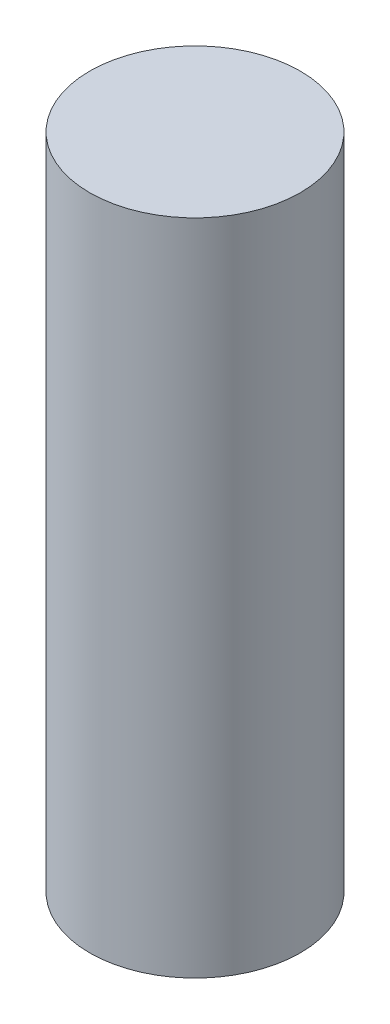
ISO-10303-21;
HEADER;
FILE_DESCRIPTION(('STEP AP214'),'2;1');
FILE_NAME('part.step','',(''),(''),'','','');
FILE_SCHEMA(('AUTOMOTIVE_DESIGN { 1 0 10303 214 1 1 1 1 }'));
ENDSEC;
DATA;
#1=APPLICATION_CONTEXT('core data for automotive mechanical design processes');
#2=APPLICATION_PROTOCOL_DEFINITION('international standard','automotive_design',2000,#1);
#3=PRODUCT_CONTEXT('',#1,'mechanical');
#4=PRODUCT('Part','Part','',(#3));
#5=PRODUCT_RELATED_PRODUCT_CATEGORY('part','',(#4));
#6=PRODUCT_DEFINITION_FORMATION('','',#4);
#7=PRODUCT_DEFINITION_CONTEXT('part definition',#1,'design');
#8=PRODUCT_DEFINITION('design','',#6,#7);
#9=PRODUCT_DEFINITION_SHAPE('','',#8);
#10=(LENGTH_UNIT() NAMED_UNIT(*) SI_UNIT(.MILLI.,.METRE.));
#11=(NAMED_UNIT(*) PLANE_ANGLE_UNIT() SI_UNIT($,.RADIAN.));
#12=(NAMED_UNIT(*) SI_UNIT($,.STERADIAN.) SOLID_ANGLE_UNIT());
#13=UNCERTAINTY_MEASURE_WITH_UNIT(LENGTH_MEASURE(1.E-05),#10,'distance_accuracy_value','');
#14=(GEOMETRIC_REPRESENTATION_CONTEXT(3) GLOBAL_UNCERTAINTY_ASSIGNED_CONTEXT((#13)) GLOBAL_UNIT_ASSIGNED_CONTEXT((#10,
#11,#12)) REPRESENTATION_CONTEXT('',''));
#15=CARTESIAN_POINT('',(0.,0.,0.));
#16=DIRECTION('',(0.,0.,1.));
#17=DIRECTION('',(1.,0.,0.));
#18=AXIS2_PLACEMENT_3D('',#15,#16,#17);
#19=CARTESIAN_POINT('',(0.,25.,0.));
#20=DIRECTION('',(0.,-1.,0.));
#21=DIRECTION('',(0.,0.,-1.));
#22=AXIS2_PLACEMENT_3D('',#19,#20,#21);
#23=CYLINDRICAL_SURFACE('',#22,4.);
#24=CARTESIAN_POINT('',(0.,25.,0.));
#25=DIRECTION('',(0.,1.,0.));
#26=DIRECTION('',(0.,0.,1.));
#27=AXIS2_PLACEMENT_3D('',#24,#25,#26);
#28=CIRCLE('',#27,4.);
#29=CARTESIAN_POINT('',(0.,25.,4.));
#30=VERTEX_POINT('',#29);
#31=EDGE_CURVE('E10',#30,#30,#28,.T.);
#32=ORIENTED_EDGE('',*,*,#31,.F.);
#33=EDGE_LOOP('',(#32));
#34=FACE_BOUND('',#33,.T.);
#35=CARTESIAN_POINT('',(0.,0.,0.));
#36=DIRECTION('',(0.,1.,0.));
#37=DIRECTION('',(0.,0.,1.));
#38=AXIS2_PLACEMENT_3D('',#35,#36,#37);
#39=CIRCLE('',#38,4.);
#40=CARTESIAN_POINT('',(0.,0.,4.));
#41=VERTEX_POINT('',#40);
#42=EDGE_CURVE('E32',#41,#41,#39,.T.);
#43=ORIENTED_EDGE('',*,*,#42,.T.);
#44=EDGE_LOOP('',(#43));
#45=FACE_BOUND('',#44,.T.);
#46=ADVANCED_FACE('F29',(#34,#45),#23,.T.);
#47=CARTESIAN_POINT('',(0.,25.,0.));
#48=DIRECTION('',(0.,1.,0.));
#49=DIRECTION('',(0.,0.,1.));
#50=AXIS2_PLACEMENT_3D('',#47,#48,#49);
#51=PLANE('',#50);
#52=ORIENTED_EDGE('',*,*,#31,.T.);
#53=EDGE_LOOP('',(#52));
#54=FACE_BOUND('',#53,.T.);
#55=ADVANCED_FACE('F44',(#54),#51,.T.);
#56=CARTESIAN_POINT('',(0.,0.,0.));
#57=DIRECTION('',(0.,1.,0.));
#58=DIRECTION('',(0.,0.,1.));
#59=AXIS2_PLACEMENT_3D('',#56,#57,#58);
#60=PLANE('',#59);
#61=ORIENTED_EDGE('',*,*,#42,.F.);
#62=EDGE_LOOP('',(#61));
#63=FACE_BOUND('',#62,.T.);
#64=ADVANCED_FACE('F42',(#63),#60,.F.);
#65=CLOSED_SHELL('',(#46,#55,#64));
#66=MANIFOLD_SOLID_BREP('B2',#65);
#67=ADVANCED_BREP_SHAPE_REPRESENTATION('',(#18,#66),#14);
#68=SHAPE_DEFINITION_REPRESENTATION(#9,#67);
ENDSEC;
END-ISO-10303-21;
